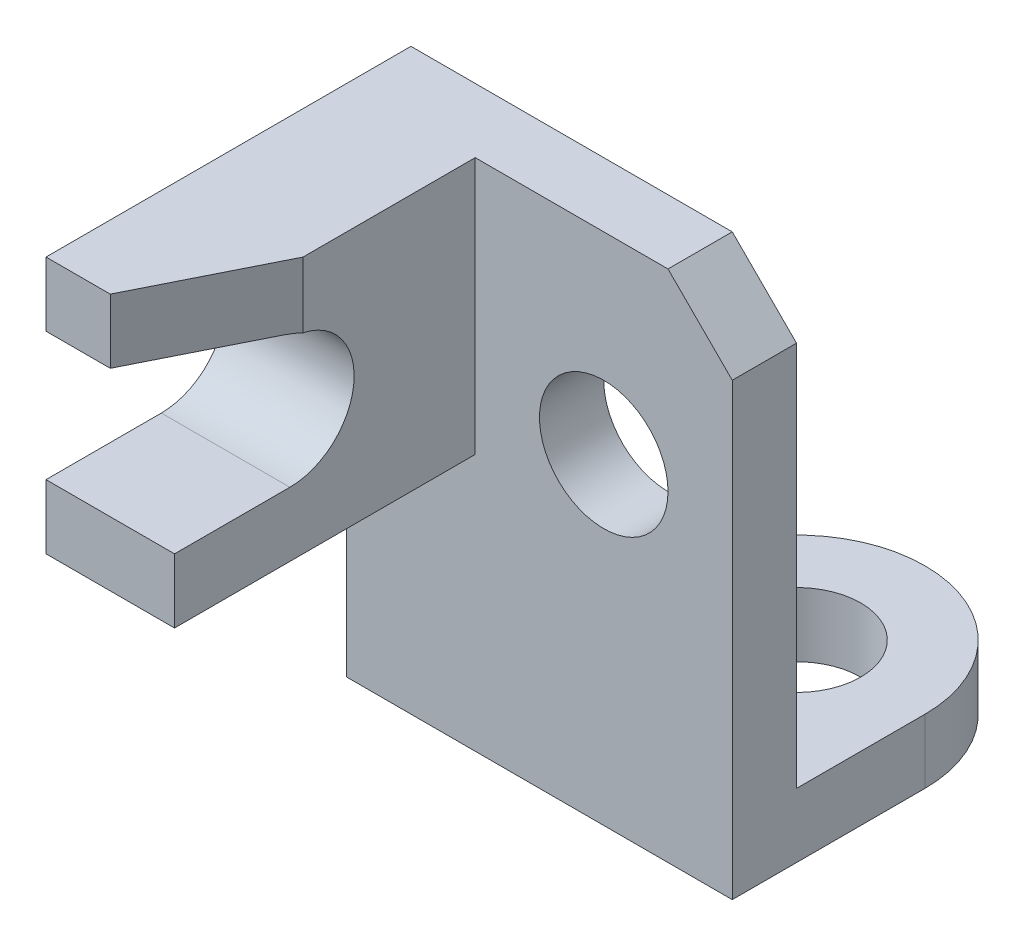
ISO-10303-21;
HEADER;
FILE_DESCRIPTION(('STEP AP214'),'2;1');
FILE_NAME('part.step','',(''),(''),'','','');
FILE_SCHEMA(('AUTOMOTIVE_DESIGN { 1 0 10303 214 1 1 1 1 }'));
ENDSEC;
DATA;
#1=APPLICATION_CONTEXT('core data for automotive mechanical design processes');
#2=APPLICATION_PROTOCOL_DEFINITION('international standard','automotive_design',2000,#1);
#3=PRODUCT_CONTEXT('',#1,'mechanical');
#4=PRODUCT('Part','Part','',(#3));
#5=PRODUCT_RELATED_PRODUCT_CATEGORY('part','',(#4));
#6=PRODUCT_DEFINITION_FORMATION('','',#4);
#7=PRODUCT_DEFINITION_CONTEXT('part definition',#1,'design');
#8=PRODUCT_DEFINITION('design','',#6,#7);
#9=PRODUCT_DEFINITION_SHAPE('','',#8);
#10=(LENGTH_UNIT() NAMED_UNIT(*) SI_UNIT(.MILLI.,.METRE.));
#11=(NAMED_UNIT(*) PLANE_ANGLE_UNIT() SI_UNIT($,.RADIAN.));
#12=(NAMED_UNIT(*) SI_UNIT($,.STERADIAN.) SOLID_ANGLE_UNIT());
#13=UNCERTAINTY_MEASURE_WITH_UNIT(LENGTH_MEASURE(1.E-05),#10,'distance_accuracy_value','');
#14=(GEOMETRIC_REPRESENTATION_CONTEXT(3) GLOBAL_UNCERTAINTY_ASSIGNED_CONTEXT((#13)) GLOBAL_UNIT_ASSIGNED_CONTEXT((#10,
#11,#12)) REPRESENTATION_CONTEXT('',''));
#15=CARTESIAN_POINT('',(0.,0.,0.));
#16=DIRECTION('',(0.,0.,1.));
#17=DIRECTION('',(1.,0.,0.));
#18=AXIS2_PLACEMENT_3D('',#15,#16,#17);
#19=CARTESIAN_POINT('',(0.,0.,-1.));
#20=DIRECTION('',(0.,0.,-1.));
#21=DIRECTION('',(-1.,0.,0.));
#22=AXIS2_PLACEMENT_3D('',#19,#20,#21);
#23=PLANE('',#22);
#24=CARTESIAN_POINT('',(4.,5.,-1.));
#25=DIRECTION('',(0.,0.,1.));
#26=DIRECTION('',(1.,0.,0.));
#27=AXIS2_PLACEMENT_3D('',#24,#25,#26);
#28=CIRCLE('',#27,1.);
#29=CARTESIAN_POINT('',(5.,5.,-1.));
#30=VERTEX_POINT('',#29);
#31=EDGE_CURVE('E214',#30,#30,#28,.T.);
#32=ORIENTED_EDGE('',*,*,#31,.T.);
#33=EDGE_LOOP('',(#32));
#34=FACE_BOUND('',#33,.T.);
#35=DIRECTION('',(0.,1.,0.));
#36=VECTOR('',#35,1.);
#37=CARTESIAN_POINT('',(6.,0.,-1.));
#38=LINE('',#37,#36);
#39=CARTESIAN_POINT('',(6.,1.,-1.));
#40=VERTEX_POINT('',#39);
#41=CARTESIAN_POINT('',(6.,7.,-1.));
#42=VERTEX_POINT('',#41);
#43=EDGE_CURVE('E260',#40,#42,#38,.T.);
#44=ORIENTED_EDGE('',*,*,#43,.F.);
#45=DIRECTION('',(-1.,0.,0.));
#46=VECTOR('',#45,1.);
#47=CARTESIAN_POINT('',(2.,1.,-1.));
#48=LINE('',#47,#46);
#49=CARTESIAN_POINT('',(2.,1.,-1.));
#50=VERTEX_POINT('',#49);
#51=EDGE_CURVE('E198',#40,#50,#48,.T.);
#52=ORIENTED_EDGE('',*,*,#51,.T.);
#53=DIRECTION('',(0.,-1.,0.));
#54=VECTOR('',#53,1.);
#55=CARTESIAN_POINT('',(2.,1.,-1.));
#56=LINE('',#55,#54);
#57=CARTESIAN_POINT('',(2.,0.,-1.));
#58=VERTEX_POINT('',#57);
#59=EDGE_CURVE('E211',#50,#58,#56,.T.);
#60=ORIENTED_EDGE('',*,*,#59,.T.);
#61=DIRECTION('',(1.,0.,0.));
#62=VECTOR('',#61,1.);
#63=CARTESIAN_POINT('',(0.,0.,-1.));
#64=LINE('',#63,#62);
#65=CARTESIAN_POINT('',(0.,0.,-1.));
#66=VERTEX_POINT('',#65);
#67=EDGE_CURVE('E264',#66,#58,#64,.T.);
#68=ORIENTED_EDGE('',*,*,#67,.F.);
#69=DIRECTION('',(0.,-1.,0.));
#70=VECTOR('',#69,1.);
#71=CARTESIAN_POINT('',(0.,0.,-1.));
#72=LINE('',#71,#70);
#73=CARTESIAN_POINT('',(0.,8.,-1.));
#74=VERTEX_POINT('',#73);
#75=EDGE_CURVE('E280',#74,#66,#72,.T.);
#76=ORIENTED_EDGE('',*,*,#75,.F.);
#77=DIRECTION('',(-1.,0.,0.));
#78=VECTOR('',#77,1.);
#79=CARTESIAN_POINT('',(0.,8.,-1.));
#80=LINE('',#79,#78);
#81=CARTESIAN_POINT('',(5.,8.,-1.));
#82=VERTEX_POINT('',#81);
#83=EDGE_CURVE('E239',#82,#74,#80,.T.);
#84=ORIENTED_EDGE('',*,*,#83,.F.);
#85=DIRECTION('',(-0.707106781186548,0.707106781186548,0.));
#86=VECTOR('',#85,1.);
#87=CARTESIAN_POINT('',(5.,8.,-1.));
#88=LINE('',#87,#86);
#89=EDGE_CURVE('E263',#42,#82,#88,.T.);
#90=ORIENTED_EDGE('',*,*,#89,.F.);
#91=EDGE_LOOP('',(#44,#52,#60,#68,#76,#84,#90));
#92=FACE_BOUND('',#91,.T.);
#93=ADVANCED_FACE('F33',(#34,#92),#23,.T.);
#94=CARTESIAN_POINT('',(0.,0.,-1.));
#95=DIRECTION('',(-1.,0.,0.));
#96=DIRECTION('',(0.,0.,1.));
#97=AXIS2_PLACEMENT_3D('',#94,#95,#96);
#98=PLANE('',#97);
#99=DIRECTION('',(0.,-1.,0.));
#100=VECTOR('',#99,1.);
#101=CARTESIAN_POINT('',(0.,0.,0.));
#102=LINE('',#101,#100);
#103=CARTESIAN_POINT('',(0.,4.,0.));
#104=VERTEX_POINT('',#103);
#105=CARTESIAN_POINT('',(0.,0.,0.));
#106=VERTEX_POINT('',#105);
#107=EDGE_CURVE('E230',#104,#106,#102,.T.);
#108=ORIENTED_EDGE('',*,*,#107,.F.);
#109=DIRECTION('',(0.,0.,1.));
#110=VECTOR('',#109,1.);
#111=CARTESIAN_POINT('',(0.,4.,0.));
#112=LINE('',#111,#110);
#113=CARTESIAN_POINT('',(0.,4.,4.67884155170663));
#114=VERTEX_POINT('',#113);
#115=EDGE_CURVE('E55',#104,#114,#112,.T.);
#116=ORIENTED_EDGE('',*,*,#115,.T.);
#117=DIRECTION('',(0.,1.,0.));
#118=VECTOR('',#117,1.);
#119=CARTESIAN_POINT('',(0.,4.,4.67884155170663));
#120=LINE('',#119,#118);
#121=CARTESIAN_POINT('',(0.,5.,4.67884155170663));
#122=VERTEX_POINT('',#121);
#123=EDGE_CURVE('E372',#114,#122,#120,.T.);
#124=ORIENTED_EDGE('',*,*,#123,.T.);
#125=DIRECTION('',(0.,0.,-1.));
#126=VECTOR('',#125,1.);
#127=CARTESIAN_POINT('',(0.,5.,4.67884155170663));
#128=LINE('',#127,#126);
#129=CARTESIAN_POINT('',(0.,5.,2.88421966528134));
#130=VERTEX_POINT('',#129);
#131=EDGE_CURVE('E374',#122,#130,#128,.T.);
#132=ORIENTED_EDGE('',*,*,#131,.T.);
#133=CARTESIAN_POINT('',(0.,6.,2.88421966528134));
#134=DIRECTION('',(1.,0.,0.));
#135=DIRECTION('',(0.,0.,-1.));
#136=AXIS2_PLACEMENT_3D('',#133,#134,#135);
#137=CIRCLE('',#136,1.);
#138=CARTESIAN_POINT('',(0.,7.,2.88421966528134));
#139=VERTEX_POINT('',#138);
#140=EDGE_CURVE('E377',#130,#139,#137,.T.);
#141=ORIENTED_EDGE('',*,*,#140,.T.);
#142=DIRECTION('',(0.,0.,1.));
#143=VECTOR('',#142,1.);
#144=CARTESIAN_POINT('',(0.,7.,2.88421966528134));
#145=LINE('',#144,#143);
#146=CARTESIAN_POINT('',(0.,7.,4.67884155170663));
#147=VERTEX_POINT('',#146);
#148=EDGE_CURVE('E169',#139,#147,#145,.T.);
#149=ORIENTED_EDGE('',*,*,#148,.T.);
#150=DIRECTION('',(0.,1.,0.));
#151=VECTOR('',#150,1.);
#152=CARTESIAN_POINT('',(0.,7.,4.67884155170663));
#153=LINE('',#152,#151);
#154=CARTESIAN_POINT('',(0.,8.,4.67884155170663));
#155=VERTEX_POINT('',#154);
#156=EDGE_CURVE('E165',#147,#155,#153,.T.);
#157=ORIENTED_EDGE('',*,*,#156,.T.);
#158=DIRECTION('',(0.,0.,1.));
#159=VECTOR('',#158,1.);
#160=CARTESIAN_POINT('',(0.,8.,-1.));
#161=LINE('',#160,#159);
#162=EDGE_CURVE('E41',#74,#155,#161,.T.);
#163=ORIENTED_EDGE('',*,*,#162,.F.);
#164=ORIENTED_EDGE('',*,*,#75,.T.);
#165=DIRECTION('',(0.,0.,1.));
#166=VECTOR('',#165,1.);
#167=CARTESIAN_POINT('',(0.,0.,-1.));
#168=LINE('',#167,#166);
#169=EDGE_CURVE('E257',#66,#106,#168,.T.);
#170=ORIENTED_EDGE('',*,*,#169,.T.);
#171=EDGE_LOOP('',(#108,#116,#124,#132,#141,#149,#157,#163,#164,#170));
#172=FACE_BOUND('',#171,.T.);
#173=ADVANCED_FACE('F35',(#172),#98,.T.);
#174=CARTESIAN_POINT('',(0.,8.,-1.));
#175=DIRECTION('',(0.,1.,0.));
#176=DIRECTION('',(0.,0.,1.));
#177=AXIS2_PLACEMENT_3D('',#174,#175,#176);
#178=PLANE('',#177);
#179=DIRECTION('',(-0.447213595499958,0.,0.894427190999916));
#180=VECTOR('',#179,1.);
#181=CARTESIAN_POINT('',(1.,8.,4.67884155170663));
#182=LINE('',#181,#180);
#183=CARTESIAN_POINT('',(2.,8.,2.67884155170663));
#184=VERTEX_POINT('',#183);
#185=CARTESIAN_POINT('',(1.,8.,4.67884155170663));
#186=VERTEX_POINT('',#185);
#187=EDGE_CURVE('E144',#184,#186,#182,.T.);
#188=ORIENTED_EDGE('',*,*,#187,.F.);
#189=DIRECTION('',(0.,0.,-1.));
#190=VECTOR('',#189,1.);
#191=CARTESIAN_POINT('',(2.,8.,4.67884155170663));
#192=LINE('',#191,#190);
#193=CARTESIAN_POINT('',(2.,8.,0.));
#194=VERTEX_POINT('',#193);
#195=EDGE_CURVE('E154',#184,#194,#192,.T.);
#196=ORIENTED_EDGE('',*,*,#195,.T.);
#197=DIRECTION('',(-1.,0.,0.));
#198=VECTOR('',#197,1.);
#199=CARTESIAN_POINT('',(0.,8.,0.));
#200=LINE('',#199,#198);
#201=CARTESIAN_POINT('',(5.,8.,0.));
#202=VERTEX_POINT('',#201);
#203=EDGE_CURVE('E234',#202,#194,#200,.T.);
#204=ORIENTED_EDGE('',*,*,#203,.F.);
#205=DIRECTION('',(0.,0.,1.));
#206=VECTOR('',#205,1.);
#207=CARTESIAN_POINT('',(5.,8.,-1.));
#208=LINE('',#207,#206);
#209=EDGE_CURVE('E251',#82,#202,#208,.T.);
#210=ORIENTED_EDGE('',*,*,#209,.F.);
#211=ORIENTED_EDGE('',*,*,#83,.T.);
#212=ORIENTED_EDGE('',*,*,#162,.T.);
#213=DIRECTION('',(-1.,0.,0.));
#214=VECTOR('',#213,1.);
#215=CARTESIAN_POINT('',(2.,8.,4.67884155170663));
#216=LINE('',#215,#214);
#217=EDGE_CURVE('E157',#186,#155,#216,.T.);
#218=ORIENTED_EDGE('',*,*,#217,.F.);
#219=EDGE_LOOP('',(#188,#196,#204,#210,#211,#212,#218));
#220=FACE_BOUND('',#219,.T.);
#221=ADVANCED_FACE('F152',(#220),#178,.T.);
#222=CARTESIAN_POINT('',(5.,8.,-1.));
#223=DIRECTION('',(0.707106781186547,0.707106781186547,0.));
#224=DIRECTION('',(-0.707106781186548,0.707106781186548,0.));
#225=AXIS2_PLACEMENT_3D('',#222,#223,#224);
#226=PLANE('',#225);
#227=DIRECTION('',(-0.707106781186548,0.707106781186548,0.));
#228=VECTOR('',#227,1.);
#229=CARTESIAN_POINT('',(5.,8.,0.));
#230=LINE('',#229,#228);
#231=CARTESIAN_POINT('',(6.,7.,0.));
#232=VERTEX_POINT('',#231);
#233=EDGE_CURVE('E246',#232,#202,#230,.T.);
#234=ORIENTED_EDGE('',*,*,#233,.F.);
#235=DIRECTION('',(0.,0.,1.));
#236=VECTOR('',#235,1.);
#237=CARTESIAN_POINT('',(6.,7.,-1.));
#238=LINE('',#237,#236);
#239=EDGE_CURVE('E253',#42,#232,#238,.T.);
#240=ORIENTED_EDGE('',*,*,#239,.F.);
#241=ORIENTED_EDGE('',*,*,#89,.T.);
#242=ORIENTED_EDGE('',*,*,#209,.T.);
#243=EDGE_LOOP('',(#234,#240,#241,#242));
#244=FACE_BOUND('',#243,.T.);
#245=ADVANCED_FACE('F314',(#244),#226,.T.);
#246=CARTESIAN_POINT('',(6.,0.,-1.));
#247=DIRECTION('',(1.,0.,0.));
#248=DIRECTION('',(0.,1.,0.));
#249=AXIS2_PLACEMENT_3D('',#246,#247,#248);
#250=PLANE('',#249);
#251=DIRECTION('',(0.,1.,0.));
#252=VECTOR('',#251,1.);
#253=CARTESIAN_POINT('',(6.,0.,0.));
#254=LINE('',#253,#252);
#255=CARTESIAN_POINT('',(6.,0.,0.));
#256=VERTEX_POINT('',#255);
#257=EDGE_CURVE('E243',#256,#232,#254,.T.);
#258=ORIENTED_EDGE('',*,*,#257,.F.);
#259=DIRECTION('',(0.,0.,1.));
#260=VECTOR('',#259,1.);
#261=CARTESIAN_POINT('',(6.,0.,-1.));
#262=LINE('',#261,#260);
#263=CARTESIAN_POINT('',(6.,0.,-2.99929198798902));
#264=VERTEX_POINT('',#263);
#265=EDGE_CURVE('E255',#264,#256,#262,.T.);
#266=ORIENTED_EDGE('',*,*,#265,.F.);
#267=DIRECTION('',(0.,-1.,0.));
#268=VECTOR('',#267,1.);
#269=CARTESIAN_POINT('',(6.,1.,-2.99929198798902));
#270=LINE('',#269,#268);
#271=CARTESIAN_POINT('',(6.,1.,-2.99929198798902));
#272=VERTEX_POINT('',#271);
#273=EDGE_CURVE('E205',#272,#264,#270,.T.);
#274=ORIENTED_EDGE('',*,*,#273,.F.);
#275=DIRECTION('',(0.,0.,1.));
#276=VECTOR('',#275,1.);
#277=CARTESIAN_POINT('',(6.,1.,-1.));
#278=LINE('',#277,#276);
#279=EDGE_CURVE('E201',#272,#40,#278,.T.);
#280=ORIENTED_EDGE('',*,*,#279,.T.);
#281=ORIENTED_EDGE('',*,*,#43,.T.);
#282=ORIENTED_EDGE('',*,*,#239,.T.);
#283=EDGE_LOOP('',(#258,#266,#274,#280,#281,#282));
#284=FACE_BOUND('',#283,.T.);
#285=ADVANCED_FACE('F317',(#284),#250,.T.);
#286=CARTESIAN_POINT('',(0.,0.,-1.));
#287=DIRECTION('',(0.,-1.,0.));
#288=DIRECTION('',(0.,0.,-1.));
#289=AXIS2_PLACEMENT_3D('',#286,#287,#288);
#290=PLANE('',#289);
#291=DIRECTION('',(1.,0.,0.));
#292=VECTOR('',#291,1.);
#293=CARTESIAN_POINT('',(0.,0.,0.));
#294=LINE('',#293,#292);
#295=EDGE_CURVE('E233',#106,#256,#294,.T.);
#296=ORIENTED_EDGE('',*,*,#295,.F.);
#297=ORIENTED_EDGE('',*,*,#169,.F.);
#298=ORIENTED_EDGE('',*,*,#67,.T.);
#299=DIRECTION('',(0.,0.,-1.));
#300=VECTOR('',#299,1.);
#301=CARTESIAN_POINT('',(2.,0.,-2.99929198798902));
#302=LINE('',#301,#300);
#303=CARTESIAN_POINT('',(2.,0.,-2.99929198798902));
#304=VERTEX_POINT('',#303);
#305=EDGE_CURVE('E190',#58,#304,#302,.T.);
#306=ORIENTED_EDGE('',*,*,#305,.T.);
#307=CARTESIAN_POINT('',(4.,0.,-2.99929198798902));
#308=DIRECTION('',(0.,-1.,0.));
#309=DIRECTION('',(0.,0.,1.));
#310=AXIS2_PLACEMENT_3D('',#307,#308,#309);
#311=CIRCLE('',#310,2.);
#312=EDGE_CURVE('E202',#304,#264,#311,.T.);
#313=ORIENTED_EDGE('',*,*,#312,.T.);
#314=ORIENTED_EDGE('',*,*,#265,.T.);
#315=EDGE_LOOP('',(#296,#297,#298,#306,#313,#314));
#316=FACE_BOUND('',#315,.T.);
#317=CARTESIAN_POINT('',(4.,0.,-2.99929198798902));
#318=DIRECTION('',(0.,-1.,0.));
#319=DIRECTION('',(0.,0.,-1.));
#320=AXIS2_PLACEMENT_3D('',#317,#318,#319);
#321=CIRCLE('',#320,1.);
#322=CARTESIAN_POINT('',(4.,0.,-3.99929198798902));
#323=VERTEX_POINT('',#322);
#324=EDGE_CURVE('E191',#323,#323,#321,.T.);
#325=ORIENTED_EDGE('',*,*,#324,.F.);
#326=EDGE_LOOP('',(#325));
#327=FACE_BOUND('',#326,.T.);
#328=ADVANCED_FACE('F302',(#316,#327),#290,.T.);
#329=CARTESIAN_POINT('',(0.,0.,0.));
#330=DIRECTION('',(0.,0.,-1.));
#331=DIRECTION('',(-1.,0.,0.));
#332=AXIS2_PLACEMENT_3D('',#329,#330,#331);
#333=PLANE('',#332);
#334=CARTESIAN_POINT('',(4.,5.,0.));
#335=DIRECTION('',(0.,0.,1.));
#336=DIRECTION('',(1.,0.,0.));
#337=AXIS2_PLACEMENT_3D('',#334,#335,#336);
#338=CIRCLE('',#337,1.);
#339=CARTESIAN_POINT('',(5.,5.,0.));
#340=VERTEX_POINT('',#339);
#341=EDGE_CURVE('E208',#340,#340,#338,.T.);
#342=ORIENTED_EDGE('',*,*,#341,.F.);
#343=EDGE_LOOP('',(#342));
#344=FACE_BOUND('',#343,.T.);
#345=ORIENTED_EDGE('',*,*,#203,.T.);
#346=DIRECTION('',(0.,-1.,0.));
#347=VECTOR('',#346,1.);
#348=CARTESIAN_POINT('',(2.,8.,0.));
#349=LINE('',#348,#347);
#350=CARTESIAN_POINT('',(2.,4.,0.));
#351=VERTEX_POINT('',#350);
#352=EDGE_CURVE('E163',#194,#351,#349,.T.);
#353=ORIENTED_EDGE('',*,*,#352,.T.);
#354=DIRECTION('',(-1.,0.,0.));
#355=VECTOR('',#354,1.);
#356=CARTESIAN_POINT('',(2.,4.,0.));
#357=LINE('',#356,#355);
#358=EDGE_CURVE('E176',#351,#104,#357,.T.);
#359=ORIENTED_EDGE('',*,*,#358,.T.);
#360=ORIENTED_EDGE('',*,*,#107,.T.);
#361=ORIENTED_EDGE('',*,*,#295,.T.);
#362=ORIENTED_EDGE('',*,*,#257,.T.);
#363=ORIENTED_EDGE('',*,*,#233,.T.);
#364=EDGE_LOOP('',(#345,#353,#359,#360,#361,#362,#363));
#365=FACE_BOUND('',#364,.T.);
#366=ADVANCED_FACE('F293',(#344,#365),#333,.F.);
#367=CARTESIAN_POINT('',(4.,5.,-1.));
#368=DIRECTION('',(0.,0.,1.));
#369=DIRECTION('',(1.,0.,0.));
#370=AXIS2_PLACEMENT_3D('',#367,#368,#369);
#371=CYLINDRICAL_SURFACE('',#370,1.);
#372=ORIENTED_EDGE('',*,*,#31,.F.);
#373=EDGE_LOOP('',(#372));
#374=FACE_BOUND('',#373,.T.);
#375=ORIENTED_EDGE('',*,*,#341,.T.);
#376=EDGE_LOOP('',(#375));
#377=FACE_BOUND('',#376,.T.);
#378=ADVANCED_FACE('F290',(#374,#377),#371,.F.);
#379=CARTESIAN_POINT('',(4.,1.,-2.99929198798902));
#380=DIRECTION('',(0.,-1.,0.));
#381=DIRECTION('',(0.,0.,-1.));
#382=AXIS2_PLACEMENT_3D('',#379,#380,#381);
#383=CYLINDRICAL_SURFACE('',#382,2.);
#384=ORIENTED_EDGE('',*,*,#312,.F.);
#385=DIRECTION('',(0.,-1.,0.));
#386=VECTOR('',#385,1.);
#387=CARTESIAN_POINT('',(2.,1.,-2.99929198798902));
#388=LINE('',#387,#386);
#389=CARTESIAN_POINT('',(2.,1.,-2.99929198798902));
#390=VERTEX_POINT('',#389);
#391=EDGE_CURVE('E209',#390,#304,#388,.T.);
#392=ORIENTED_EDGE('',*,*,#391,.F.);
#393=CARTESIAN_POINT('',(4.,1.,-2.99929198798902));
#394=DIRECTION('',(0.,-1.,0.));
#395=DIRECTION('',(0.,0.,1.));
#396=AXIS2_PLACEMENT_3D('',#393,#394,#395);
#397=CIRCLE('',#396,2.);
#398=EDGE_CURVE('E197',#390,#272,#397,.T.);
#399=ORIENTED_EDGE('',*,*,#398,.T.);
#400=ORIENTED_EDGE('',*,*,#273,.T.);
#401=EDGE_LOOP('',(#384,#392,#399,#400));
#402=FACE_BOUND('',#401,.T.);
#403=ADVANCED_FACE('F292',(#402),#383,.T.);
#404=CARTESIAN_POINT('',(2.,1.,-2.99929198798902));
#405=DIRECTION('',(-1.,0.,0.));
#406=DIRECTION('',(0.,0.,1.));
#407=AXIS2_PLACEMENT_3D('',#404,#405,#406);
#408=PLANE('',#407);
#409=ORIENTED_EDGE('',*,*,#305,.F.);
#410=ORIENTED_EDGE('',*,*,#59,.F.);
#411=DIRECTION('',(0.,0.,-1.));
#412=VECTOR('',#411,1.);
#413=CARTESIAN_POINT('',(2.,1.,-2.99929198798902));
#414=LINE('',#413,#412);
#415=EDGE_CURVE('E194',#50,#390,#414,.T.);
#416=ORIENTED_EDGE('',*,*,#415,.T.);
#417=ORIENTED_EDGE('',*,*,#391,.T.);
#418=EDGE_LOOP('',(#409,#410,#416,#417));
#419=FACE_BOUND('',#418,.T.);
#420=ADVANCED_FACE('F299',(#419),#408,.T.);
#421=CARTESIAN_POINT('',(4.,1.,-2.99929198798902));
#422=DIRECTION('',(0.,1.,0.));
#423=DIRECTION('',(0.,0.,1.));
#424=AXIS2_PLACEMENT_3D('',#421,#422,#423);
#425=PLANE('',#424);
#426=CARTESIAN_POINT('',(4.,1.,-2.99929198798902));
#427=DIRECTION('',(0.,-1.,0.));
#428=DIRECTION('',(0.,0.,-1.));
#429=AXIS2_PLACEMENT_3D('',#426,#427,#428);
#430=CIRCLE('',#429,1.);
#431=CARTESIAN_POINT('',(4.,1.,-3.99929198798902));
#432=VERTEX_POINT('',#431);
#433=EDGE_CURVE('E187',#432,#432,#430,.T.);
#434=ORIENTED_EDGE('',*,*,#433,.T.);
#435=EDGE_LOOP('',(#434));
#436=FACE_BOUND('',#435,.T.);
#437=ORIENTED_EDGE('',*,*,#51,.F.);
#438=ORIENTED_EDGE('',*,*,#279,.F.);
#439=ORIENTED_EDGE('',*,*,#398,.F.);
#440=ORIENTED_EDGE('',*,*,#415,.F.);
#441=EDGE_LOOP('',(#437,#438,#439,#440));
#442=FACE_BOUND('',#441,.T.);
#443=ADVANCED_FACE('F331',(#436,#442),#425,.T.);
#444=CARTESIAN_POINT('',(4.,1.,-2.99929198798902));
#445=DIRECTION('',(0.,-1.,0.));
#446=DIRECTION('',(0.,0.,-1.));
#447=AXIS2_PLACEMENT_3D('',#444,#445,#446);
#448=CYLINDRICAL_SURFACE('',#447,1.);
#449=ORIENTED_EDGE('',*,*,#433,.F.);
#450=EDGE_LOOP('',(#449));
#451=FACE_BOUND('',#450,.T.);
#452=ORIENTED_EDGE('',*,*,#324,.T.);
#453=EDGE_LOOP('',(#452));
#454=FACE_BOUND('',#453,.T.);
#455=ADVANCED_FACE('F328',(#451,#454),#448,.F.);
#456=CARTESIAN_POINT('',(2.,7.,4.67884155170663));
#457=DIRECTION('',(0.,0.,1.));
#458=DIRECTION('',(1.,0.,0.));
#459=AXIS2_PLACEMENT_3D('',#456,#457,#458);
#460=PLANE('',#459);
#461=DIRECTION('',(0.,1.,0.));
#462=VECTOR('',#461,1.);
#463=CARTESIAN_POINT('',(1.,6.,4.67884155170663));
#464=LINE('',#463,#462);
#465=CARTESIAN_POINT('',(1.,7.,4.67884155170663));
#466=VERTEX_POINT('',#465);
#467=EDGE_CURVE('E158',#466,#186,#464,.T.);
#468=ORIENTED_EDGE('',*,*,#467,.T.);
#469=ORIENTED_EDGE('',*,*,#217,.T.);
#470=ORIENTED_EDGE('',*,*,#156,.F.);
#471=DIRECTION('',(-1.,0.,0.));
#472=VECTOR('',#471,1.);
#473=CARTESIAN_POINT('',(2.,7.,4.67884155170663));
#474=LINE('',#473,#472);
#475=EDGE_CURVE('E383',#466,#147,#474,.T.);
#476=ORIENTED_EDGE('',*,*,#475,.F.);
#477=EDGE_LOOP('',(#468,#469,#470,#476));
#478=FACE_BOUND('',#477,.T.);
#479=ADVANCED_FACE('F330',(#478),#460,.T.);
#480=CARTESIAN_POINT('',(2.,7.,2.88421966528134));
#481=DIRECTION('',(0.,-1.,0.));
#482=DIRECTION('',(0.,0.,-1.));
#483=AXIS2_PLACEMENT_3D('',#480,#481,#482);
#484=PLANE('',#483);
#485=DIRECTION('',(0.447213595499958,0.,-0.894427190999916));
#486=VECTOR('',#485,1.);
#487=CARTESIAN_POINT('',(1.91784875457011,7.,2.8431440425664));
#488=LINE('',#487,#486);
#489=CARTESIAN_POINT('',(1.89731094321264,7.,2.88421966528134));
#490=VERTEX_POINT('',#489);
#491=EDGE_CURVE('E366',#466,#490,#488,.T.);
#492=ORIENTED_EDGE('',*,*,#491,.F.);
#493=ORIENTED_EDGE('',*,*,#475,.T.);
#494=ORIENTED_EDGE('',*,*,#148,.F.);
#495=DIRECTION('',(-1.,0.,0.));
#496=VECTOR('',#495,1.);
#497=CARTESIAN_POINT('',(2.,7.,2.88421966528134));
#498=LINE('',#497,#496);
#499=EDGE_CURVE('E385',#490,#139,#498,.T.);
#500=ORIENTED_EDGE('',*,*,#499,.F.);
#501=EDGE_LOOP('',(#492,#493,#494,#500));
#502=FACE_BOUND('',#501,.T.);
#503=ADVANCED_FACE('F338',(#502),#484,.T.);
#504=CARTESIAN_POINT('',(2.,6.,2.88421966528134));
#505=DIRECTION('',(-1.,0.,0.));
#506=DIRECTION('',(0.,0.,1.));
#507=AXIS2_PLACEMENT_3D('',#504,#505,#506);
#508=CYLINDRICAL_SURFACE('',#507,1.);
#509=CARTESIAN_POINT('',(1.89731094321264,6.,2.88421966528134));
#510=DIRECTION('',(-0.894427190999916,0.,-0.447213595499958));
#511=DIRECTION('',(-0.447213595499958,0.,0.894427190999916));
#512=AXIS2_PLACEMENT_3D('',#509,#510,#511);
#513=ELLIPSE('',#512,1.11803398874989,1.);
#514=CARTESIAN_POINT('',(2.,6.97868270162729,2.67884155170663));
#515=VERTEX_POINT('',#514);
#516=EDGE_CURVE('E47',#490,#515,#513,.T.);
#517=ORIENTED_EDGE('',*,*,#516,.F.);
#518=ORIENTED_EDGE('',*,*,#499,.T.);
#519=ORIENTED_EDGE('',*,*,#140,.F.);
#520=DIRECTION('',(-1.,0.,0.));
#521=VECTOR('',#520,1.);
#522=CARTESIAN_POINT('',(2.,5.,2.88421966528134));
#523=LINE('',#522,#521);
#524=CARTESIAN_POINT('',(2.,5.,2.88421966528134));
#525=VERTEX_POINT('',#524);
#526=EDGE_CURVE('E387',#525,#130,#523,.T.);
#527=ORIENTED_EDGE('',*,*,#526,.F.);
#528=CARTESIAN_POINT('',(2.,6.,2.88421966528134));
#529=DIRECTION('',(1.,0.,0.));
#530=DIRECTION('',(0.,0.,-1.));
#531=AXIS2_PLACEMENT_3D('',#528,#529,#530);
#532=CIRCLE('',#531,1.);
#533=EDGE_CURVE('E180',#525,#515,#532,.T.);
#534=ORIENTED_EDGE('',*,*,#533,.T.);
#535=EDGE_LOOP('',(#517,#518,#519,#527,#534));
#536=FACE_BOUND('',#535,.T.);
#537=ADVANCED_FACE('F397',(#536),#508,.F.);
#538=CARTESIAN_POINT('',(2.,5.,4.67884155170663));
#539=DIRECTION('',(0.,1.,0.));
#540=DIRECTION('',(0.,0.,1.));
#541=AXIS2_PLACEMENT_3D('',#538,#539,#540);
#542=PLANE('',#541);
#543=ORIENTED_EDGE('',*,*,#131,.F.);
#544=DIRECTION('',(-1.,0.,0.));
#545=VECTOR('',#544,1.);
#546=CARTESIAN_POINT('',(2.,5.,4.67884155170663));
#547=LINE('',#546,#545);
#548=CARTESIAN_POINT('',(2.,5.,4.67884155170663));
#549=VERTEX_POINT('',#548);
#550=EDGE_CURVE('E388',#549,#122,#547,.T.);
#551=ORIENTED_EDGE('',*,*,#550,.F.);
#552=DIRECTION('',(0.,0.,-1.));
#553=VECTOR('',#552,1.);
#554=CARTESIAN_POINT('',(2.,5.,4.67884155170663));
#555=LINE('',#554,#553);
#556=EDGE_CURVE('E363',#549,#525,#555,.T.);
#557=ORIENTED_EDGE('',*,*,#556,.T.);
#558=ORIENTED_EDGE('',*,*,#526,.T.);
#559=EDGE_LOOP('',(#543,#551,#557,#558));
#560=FACE_BOUND('',#559,.T.);
#561=ADVANCED_FACE('F395',(#560),#542,.T.);
#562=CARTESIAN_POINT('',(2.,4.,4.67884155170663));
#563=DIRECTION('',(0.,0.,1.));
#564=DIRECTION('',(0.,-1.,0.));
#565=AXIS2_PLACEMENT_3D('',#562,#563,#564);
#566=PLANE('',#565);
#567=ORIENTED_EDGE('',*,*,#123,.F.);
#568=DIRECTION('',(-1.,0.,0.));
#569=VECTOR('',#568,1.);
#570=CARTESIAN_POINT('',(2.,4.,4.67884155170663));
#571=LINE('',#570,#569);
#572=CARTESIAN_POINT('',(2.,4.,4.67884155170663));
#573=VERTEX_POINT('',#572);
#574=EDGE_CURVE('E179',#573,#114,#571,.T.);
#575=ORIENTED_EDGE('',*,*,#574,.F.);
#576=DIRECTION('',(0.,1.,0.));
#577=VECTOR('',#576,1.);
#578=CARTESIAN_POINT('',(2.,4.,4.67884155170663));
#579=LINE('',#578,#577);
#580=EDGE_CURVE('E361',#573,#549,#579,.T.);
#581=ORIENTED_EDGE('',*,*,#580,.T.);
#582=ORIENTED_EDGE('',*,*,#550,.T.);
#583=EDGE_LOOP('',(#567,#575,#581,#582));
#584=FACE_BOUND('',#583,.T.);
#585=ADVANCED_FACE('F392',(#584),#566,.T.);
#586=CARTESIAN_POINT('',(2.,4.,0.));
#587=DIRECTION('',(0.,-1.,0.));
#588=DIRECTION('',(0.,0.,-1.));
#589=AXIS2_PLACEMENT_3D('',#586,#587,#588);
#590=PLANE('',#589);
#591=ORIENTED_EDGE('',*,*,#115,.F.);
#592=ORIENTED_EDGE('',*,*,#358,.F.);
#593=DIRECTION('',(0.,0.,1.));
#594=VECTOR('',#593,1.);
#595=CARTESIAN_POINT('',(2.,4.,0.));
#596=LINE('',#595,#594);
#597=EDGE_CURVE('E166',#351,#573,#596,.T.);
#598=ORIENTED_EDGE('',*,*,#597,.T.);
#599=ORIENTED_EDGE('',*,*,#574,.T.);
#600=EDGE_LOOP('',(#591,#592,#598,#599));
#601=FACE_BOUND('',#600,.T.);
#602=ADVANCED_FACE('F345',(#601),#590,.T.);
#603=CARTESIAN_POINT('',(2.,6.,2.88421966528134));
#604=DIRECTION('',(1.,0.,0.));
#605=DIRECTION('',(0.,0.,-1.));
#606=AXIS2_PLACEMENT_3D('',#603,#604,#605);
#607=PLANE('',#606);
#608=DIRECTION('',(0.,1.,0.));
#609=VECTOR('',#608,1.);
#610=CARTESIAN_POINT('',(2.,6.,2.67884155170663));
#611=LINE('',#610,#609);
#612=EDGE_CURVE('E11',#515,#184,#611,.T.);
#613=ORIENTED_EDGE('',*,*,#612,.F.);
#614=ORIENTED_EDGE('',*,*,#533,.F.);
#615=ORIENTED_EDGE('',*,*,#556,.F.);
#616=ORIENTED_EDGE('',*,*,#580,.F.);
#617=ORIENTED_EDGE('',*,*,#597,.F.);
#618=ORIENTED_EDGE('',*,*,#352,.F.);
#619=ORIENTED_EDGE('',*,*,#195,.F.);
#620=EDGE_LOOP('',(#613,#614,#615,#616,#617,#618,#619));
#621=FACE_BOUND('',#620,.T.);
#622=ADVANCED_FACE('F160',(#621),#607,.T.);
#623=CARTESIAN_POINT('',(1.,6.,4.67884155170663));
#624=DIRECTION('',(-0.894427190999916,0.,-0.447213595499958));
#625=DIRECTION('',(-0.447213595499958,0.,0.894427190999916));
#626=AXIS2_PLACEMENT_3D('',#623,#624,#625);
#627=PLANE('',#626);
#628=ORIENTED_EDGE('',*,*,#491,.T.);
#629=ORIENTED_EDGE('',*,*,#516,.T.);
#630=ORIENTED_EDGE('',*,*,#612,.T.);
#631=ORIENTED_EDGE('',*,*,#187,.T.);
#632=ORIENTED_EDGE('',*,*,#467,.F.);
#633=EDGE_LOOP('',(#628,#629,#630,#631,#632));
#634=FACE_BOUND('',#633,.T.);
#635=ADVANCED_FACE('F143',(#634),#627,.F.);
#636=CLOSED_SHELL('',(#93,#173,#221,#245,#285,#328,#366,#378,#403,#420,#443,#455,#479,#503,#537,
#561,#585,#602,#622,#635));
#637=MANIFOLD_SOLID_BREP('B2',#636);
#638=ADVANCED_BREP_SHAPE_REPRESENTATION('',(#18,#637),#14);
#639=SHAPE_DEFINITION_REPRESENTATION(#9,#638);
ENDSEC;
END-ISO-10303-21;
